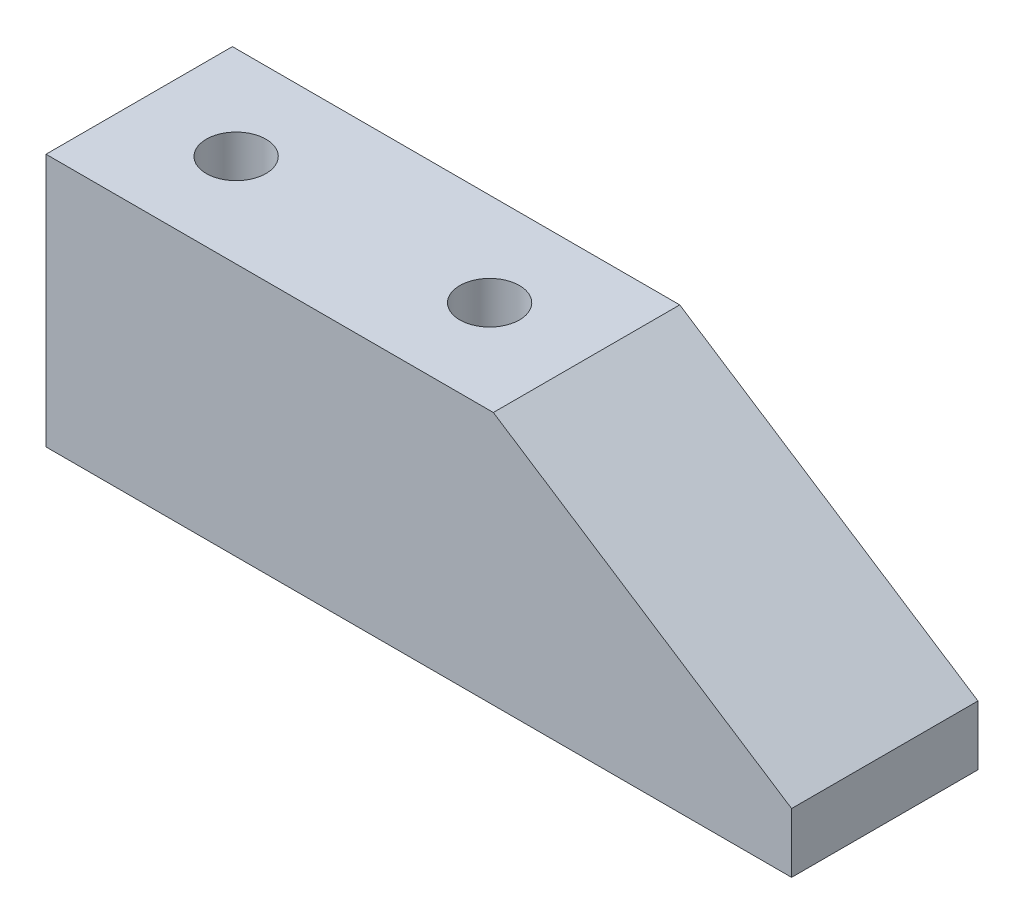
ISO-10303-21;
HEADER;
FILE_DESCRIPTION(('STEP AP214'),'2;1');
FILE_NAME('part.step','',(''),(''),'','','');
FILE_SCHEMA(('AUTOMOTIVE_DESIGN { 1 0 10303 214 1 1 1 1 }'));
ENDSEC;
DATA;
#1=APPLICATION_CONTEXT('core data for automotive mechanical design processes');
#2=APPLICATION_PROTOCOL_DEFINITION('international standard','automotive_design',2000,#1);
#3=PRODUCT_CONTEXT('',#1,'mechanical');
#4=PRODUCT('Part','Part','',(#3));
#5=PRODUCT_RELATED_PRODUCT_CATEGORY('part','',(#4));
#6=PRODUCT_DEFINITION_FORMATION('','',#4);
#7=PRODUCT_DEFINITION_CONTEXT('part definition',#1,'design');
#8=PRODUCT_DEFINITION('design','',#6,#7);
#9=PRODUCT_DEFINITION_SHAPE('','',#8);
#10=(LENGTH_UNIT() NAMED_UNIT(*) SI_UNIT(.MILLI.,.METRE.));
#11=(NAMED_UNIT(*) PLANE_ANGLE_UNIT() SI_UNIT($,.RADIAN.));
#12=(NAMED_UNIT(*) SI_UNIT($,.STERADIAN.) SOLID_ANGLE_UNIT());
#13=UNCERTAINTY_MEASURE_WITH_UNIT(LENGTH_MEASURE(1.E-05),#10,'distance_accuracy_value','');
#14=(GEOMETRIC_REPRESENTATION_CONTEXT(3) GLOBAL_UNCERTAINTY_ASSIGNED_CONTEXT((#13)) GLOBAL_UNIT_ASSIGNED_CONTEXT((#10,
#11,#12)) REPRESENTATION_CONTEXT('',''));
#15=CARTESIAN_POINT('',(0.,0.,0.));
#16=DIRECTION('',(0.,0.,1.));
#17=DIRECTION('',(1.,0.,0.));
#18=AXIS2_PLACEMENT_3D('',#15,#16,#17);
#19=CARTESIAN_POINT('',(30.,0.,12.5));
#20=DIRECTION('',(0.,-1.,0.));
#21=DIRECTION('',(1.,0.,0.));
#22=AXIS2_PLACEMENT_3D('',#19,#20,#21);
#23=PLANE('',#22);
#24=CARTESIAN_POINT('',(6.5,0.,6.25));
#25=DIRECTION('',(0.,1.,0.));
#26=DIRECTION('',(-1.,0.,0.));
#27=AXIS2_PLACEMENT_3D('',#24,#25,#26);
#28=CIRCLE('',#27,2.);
#29=CARTESIAN_POINT('',(4.5,0.,6.25));
#30=VERTEX_POINT('',#29);
#31=EDGE_CURVE('E162',#30,#30,#28,.T.);
#32=ORIENTED_EDGE('',*,*,#31,.F.);
#33=EDGE_LOOP('',(#32));
#34=FACE_BOUND('',#33,.T.);
#35=CARTESIAN_POINT('',(23.5,0.,6.25));
#36=DIRECTION('',(0.,1.,0.));
#37=DIRECTION('',(1.,0.,0.));
#38=AXIS2_PLACEMENT_3D('',#35,#36,#37);
#39=CIRCLE('',#38,2.);
#40=CARTESIAN_POINT('',(25.5,0.,6.25));
#41=VERTEX_POINT('',#40);
#42=EDGE_CURVE('E165',#41,#41,#39,.T.);
#43=ORIENTED_EDGE('',*,*,#42,.F.);
#44=EDGE_LOOP('',(#43));
#45=FACE_BOUND('',#44,.T.);
#46=DIRECTION('',(-1.,0.,0.));
#47=VECTOR('',#46,1.);
#48=CARTESIAN_POINT('',(30.,0.,0.));
#49=LINE('',#48,#47);
#50=CARTESIAN_POINT('',(30.,0.,0.));
#51=VERTEX_POINT('',#50);
#52=CARTESIAN_POINT('',(0.,0.,0.));
#53=VERTEX_POINT('',#52);
#54=EDGE_CURVE('E118',#51,#53,#49,.T.);
#55=ORIENTED_EDGE('',*,*,#54,.T.);
#56=DIRECTION('',(0.,0.,-1.));
#57=VECTOR('',#56,1.);
#58=CARTESIAN_POINT('',(0.,0.,12.5));
#59=LINE('',#58,#57);
#60=CARTESIAN_POINT('',(0.,0.,12.5));
#61=VERTEX_POINT('',#60);
#62=EDGE_CURVE('E11',#61,#53,#59,.T.);
#63=ORIENTED_EDGE('',*,*,#62,.F.);
#64=DIRECTION('',(-1.,0.,0.));
#65=VECTOR('',#64,1.);
#66=CARTESIAN_POINT('',(30.,0.,12.5));
#67=LINE('',#66,#65);
#68=CARTESIAN_POINT('',(30.,0.,12.5));
#69=VERTEX_POINT('',#68);
#70=EDGE_CURVE('E132',#69,#61,#67,.T.);
#71=ORIENTED_EDGE('',*,*,#70,.F.);
#72=DIRECTION('',(0.,0.,-1.));
#73=VECTOR('',#72,1.);
#74=CARTESIAN_POINT('',(30.,0.,12.5));
#75=LINE('',#74,#73);
#76=EDGE_CURVE('E114',#69,#51,#75,.T.);
#77=ORIENTED_EDGE('',*,*,#76,.T.);
#78=EDGE_LOOP('',(#55,#63,#71,#77));
#79=FACE_BOUND('',#78,.T.);
#80=ADVANCED_FACE('F39',(#34,#45,#79),#23,.F.);
#81=CARTESIAN_POINT('',(0.,0.,12.5));
#82=DIRECTION('',(1.,0.,0.));
#83=DIRECTION('',(0.,1.,0.));
#84=AXIS2_PLACEMENT_3D('',#81,#82,#83);
#85=PLANE('',#84);
#86=DIRECTION('',(0.,-1.,0.));
#87=VECTOR('',#86,1.);
#88=CARTESIAN_POINT('',(0.,0.,0.));
#89=LINE('',#88,#87);
#90=CARTESIAN_POINT('',(0.,-17.,0.));
#91=VERTEX_POINT('',#90);
#92=EDGE_CURVE('E122',#53,#91,#89,.T.);
#93=ORIENTED_EDGE('',*,*,#92,.T.);
#94=DIRECTION('',(0.,0.,-1.));
#95=VECTOR('',#94,1.);
#96=CARTESIAN_POINT('',(0.,-17.,12.5));
#97=LINE('',#96,#95);
#98=CARTESIAN_POINT('',(0.,-17.,12.5));
#99=VERTEX_POINT('',#98);
#100=EDGE_CURVE('E48',#99,#91,#97,.T.);
#101=ORIENTED_EDGE('',*,*,#100,.F.);
#102=DIRECTION('',(0.,-1.,0.));
#103=VECTOR('',#102,1.);
#104=CARTESIAN_POINT('',(0.,0.,12.5));
#105=LINE('',#104,#103);
#106=EDGE_CURVE('E90',#61,#99,#105,.T.);
#107=ORIENTED_EDGE('',*,*,#106,.F.);
#108=ORIENTED_EDGE('',*,*,#62,.T.);
#109=EDGE_LOOP('',(#93,#101,#107,#108));
#110=FACE_BOUND('',#109,.T.);
#111=ADVANCED_FACE('F154',(#110),#85,.F.);
#112=CARTESIAN_POINT('',(0.,-17.,12.5));
#113=DIRECTION('',(0.,1.,0.));
#114=DIRECTION('',(0.,0.,1.));
#115=AXIS2_PLACEMENT_3D('',#112,#113,#114);
#116=PLANE('',#115);
#117=DIRECTION('',(1.,0.,0.));
#118=VECTOR('',#117,1.);
#119=CARTESIAN_POINT('',(0.,-17.,0.));
#120=LINE('',#119,#118);
#121=CARTESIAN_POINT('',(50.,-17.,0.));
#122=VERTEX_POINT('',#121);
#123=EDGE_CURVE('E106',#91,#122,#120,.T.);
#124=ORIENTED_EDGE('',*,*,#123,.T.);
#125=DIRECTION('',(0.,0.,-1.));
#126=VECTOR('',#125,1.);
#127=CARTESIAN_POINT('',(50.,-17.,12.5));
#128=LINE('',#127,#126);
#129=CARTESIAN_POINT('',(50.,-17.,12.5));
#130=VERTEX_POINT('',#129);
#131=EDGE_CURVE('E103',#130,#122,#128,.T.);
#132=ORIENTED_EDGE('',*,*,#131,.F.);
#133=DIRECTION('',(1.,0.,0.));
#134=VECTOR('',#133,1.);
#135=CARTESIAN_POINT('',(0.,-17.,12.5));
#136=LINE('',#135,#134);
#137=EDGE_CURVE('E94',#99,#130,#136,.T.);
#138=ORIENTED_EDGE('',*,*,#137,.F.);
#139=ORIENTED_EDGE('',*,*,#100,.T.);
#140=EDGE_LOOP('',(#124,#132,#138,#139));
#141=FACE_BOUND('',#140,.T.);
#142=ADVANCED_FACE('F104',(#141),#116,.F.);
#143=CARTESIAN_POINT('',(50.,-17.,12.5));
#144=DIRECTION('',(-1.,0.,0.));
#145=DIRECTION('',(0.,0.,1.));
#146=AXIS2_PLACEMENT_3D('',#143,#144,#145);
#147=PLANE('',#146);
#148=DIRECTION('',(0.,1.,0.));
#149=VECTOR('',#148,1.);
#150=CARTESIAN_POINT('',(50.,-17.,0.));
#151=LINE('',#150,#149);
#152=CARTESIAN_POINT('',(50.,-13.,0.));
#153=VERTEX_POINT('',#152);
#154=EDGE_CURVE('E76',#122,#153,#151,.T.);
#155=ORIENTED_EDGE('',*,*,#154,.T.);
#156=DIRECTION('',(0.,0.,-1.));
#157=VECTOR('',#156,1.);
#158=CARTESIAN_POINT('',(50.,-13.,12.5));
#159=LINE('',#158,#157);
#160=CARTESIAN_POINT('',(50.,-13.,12.5));
#161=VERTEX_POINT('',#160);
#162=EDGE_CURVE('E108',#161,#153,#159,.T.);
#163=ORIENTED_EDGE('',*,*,#162,.F.);
#164=DIRECTION('',(0.,1.,0.));
#165=VECTOR('',#164,1.);
#166=CARTESIAN_POINT('',(50.,-17.,12.5));
#167=LINE('',#166,#165);
#168=EDGE_CURVE('E98',#130,#161,#167,.T.);
#169=ORIENTED_EDGE('',*,*,#168,.F.);
#170=ORIENTED_EDGE('',*,*,#131,.T.);
#171=EDGE_LOOP('',(#155,#163,#169,#170));
#172=FACE_BOUND('',#171,.T.);
#173=ADVANCED_FACE('F110',(#172),#147,.F.);
#174=CARTESIAN_POINT('',(50.,-13.,12.5));
#175=DIRECTION('',(-0.544988350595414,-0.838443616300637,0.));
#176=DIRECTION('',(0.838443616300637,-0.544988350595414,0.));
#177=AXIS2_PLACEMENT_3D('',#174,#175,#176);
#178=PLANE('',#177);
#179=DIRECTION('',(-0.838443616300637,0.544988350595414,0.));
#180=VECTOR('',#179,1.);
#181=CARTESIAN_POINT('',(50.,-13.,0.));
#182=LINE('',#181,#180);
#183=EDGE_CURVE('E82',#153,#51,#182,.T.);
#184=ORIENTED_EDGE('',*,*,#183,.T.);
#185=ORIENTED_EDGE('',*,*,#76,.F.);
#186=DIRECTION('',(-0.838443616300637,0.544988350595414,0.));
#187=VECTOR('',#186,1.);
#188=CARTESIAN_POINT('',(50.,-13.,12.5));
#189=LINE('',#188,#187);
#190=EDGE_CURVE('E56',#161,#69,#189,.T.);
#191=ORIENTED_EDGE('',*,*,#190,.F.);
#192=ORIENTED_EDGE('',*,*,#162,.T.);
#193=EDGE_LOOP('',(#184,#185,#191,#192));
#194=FACE_BOUND('',#193,.T.);
#195=ADVANCED_FACE('F143',(#194),#178,.F.);
#196=CARTESIAN_POINT('',(0.,0.,12.5));
#197=DIRECTION('',(0.,0.,1.));
#198=DIRECTION('',(1.,0.,0.));
#199=AXIS2_PLACEMENT_3D('',#196,#197,#198);
#200=PLANE('',#199);
#201=ORIENTED_EDGE('',*,*,#70,.T.);
#202=ORIENTED_EDGE('',*,*,#106,.T.);
#203=ORIENTED_EDGE('',*,*,#137,.T.);
#204=ORIENTED_EDGE('',*,*,#168,.T.);
#205=ORIENTED_EDGE('',*,*,#190,.T.);
#206=EDGE_LOOP('',(#201,#202,#203,#204,#205));
#207=FACE_BOUND('',#206,.T.);
#208=ADVANCED_FACE('F96',(#207),#200,.T.);
#209=CARTESIAN_POINT('',(0.,0.,0.));
#210=DIRECTION('',(0.,0.,1.));
#211=DIRECTION('',(1.,0.,0.));
#212=AXIS2_PLACEMENT_3D('',#209,#210,#211);
#213=PLANE('',#212);
#214=ORIENTED_EDGE('',*,*,#54,.F.);
#215=ORIENTED_EDGE('',*,*,#183,.F.);
#216=ORIENTED_EDGE('',*,*,#154,.F.);
#217=ORIENTED_EDGE('',*,*,#123,.F.);
#218=ORIENTED_EDGE('',*,*,#92,.F.);
#219=EDGE_LOOP('',(#214,#215,#216,#217,#218));
#220=FACE_BOUND('',#219,.T.);
#221=ADVANCED_FACE('F139',(#220),#213,.F.);
#222=CARTESIAN_POINT('',(23.5,-8.,6.25));
#223=DIRECTION('',(0.,1.,0.));
#224=DIRECTION('',(-1.,0.,0.));
#225=AXIS2_PLACEMENT_3D('',#222,#223,#224);
#226=CYLINDRICAL_SURFACE('',#225,2.);
#227=CARTESIAN_POINT('',(23.5,-8.,6.25));
#228=DIRECTION('',(0.,1.,0.));
#229=DIRECTION('',(1.,0.,0.));
#230=AXIS2_PLACEMENT_3D('',#227,#228,#229);
#231=CIRCLE('',#230,2.);
#232=CARTESIAN_POINT('',(25.5,-8.,6.25));
#233=VERTEX_POINT('',#232);
#234=EDGE_CURVE('E168',#233,#233,#231,.T.);
#235=ORIENTED_EDGE('',*,*,#234,.F.);
#236=EDGE_LOOP('',(#235));
#237=FACE_BOUND('',#236,.T.);
#238=ORIENTED_EDGE('',*,*,#42,.T.);
#239=EDGE_LOOP('',(#238));
#240=FACE_BOUND('',#239,.T.);
#241=ADVANCED_FACE('F194',(#237,#240),#226,.F.);
#242=CARTESIAN_POINT('',(23.5,-8.,6.25));
#243=DIRECTION('',(0.,-1.,0.));
#244=DIRECTION('',(1.,0.,0.));
#245=AXIS2_PLACEMENT_3D('',#242,#243,#244);
#246=PLANE('',#245);
#247=ORIENTED_EDGE('',*,*,#234,.T.);
#248=EDGE_LOOP('',(#247));
#249=FACE_BOUND('',#248,.T.);
#250=ADVANCED_FACE('F185',(#249),#246,.F.);
#251=CARTESIAN_POINT('',(6.5,-8.,6.25));
#252=DIRECTION('',(0.,1.,0.));
#253=DIRECTION('',(-1.,0.,0.));
#254=AXIS2_PLACEMENT_3D('',#251,#252,#253);
#255=CYLINDRICAL_SURFACE('',#254,2.);
#256=CARTESIAN_POINT('',(6.5,-8.,6.25));
#257=DIRECTION('',(0.,1.,0.));
#258=DIRECTION('',(-1.,0.,0.));
#259=AXIS2_PLACEMENT_3D('',#256,#257,#258);
#260=CIRCLE('',#259,2.);
#261=CARTESIAN_POINT('',(4.5,-8.,6.25));
#262=VERTEX_POINT('',#261);
#263=EDGE_CURVE('E123',#262,#262,#260,.T.);
#264=ORIENTED_EDGE('',*,*,#263,.F.);
#265=EDGE_LOOP('',(#264));
#266=FACE_BOUND('',#265,.T.);
#267=ORIENTED_EDGE('',*,*,#31,.T.);
#268=EDGE_LOOP('',(#267));
#269=FACE_BOUND('',#268,.T.);
#270=ADVANCED_FACE('F182',(#266,#269),#255,.F.);
#271=CARTESIAN_POINT('',(6.5,-8.,6.25));
#272=DIRECTION('',(0.,1.,0.));
#273=DIRECTION('',(-1.,0.,0.));
#274=AXIS2_PLACEMENT_3D('',#271,#272,#273);
#275=PLANE('',#274);
#276=ORIENTED_EDGE('',*,*,#263,.T.);
#277=EDGE_LOOP('',(#276));
#278=FACE_BOUND('',#277,.T.);
#279=ADVANCED_FACE('F184',(#278),#275,.T.);
#280=CLOSED_SHELL('',(#80,#111,#142,#173,#195,#208,#221,#241,#250,#270,#279));
#281=MANIFOLD_SOLID_BREP('B2',#280);
#282=ADVANCED_BREP_SHAPE_REPRESENTATION('',(#18,#281),#14);
#283=SHAPE_DEFINITION_REPRESENTATION(#9,#282);
ENDSEC;
END-ISO-10303-21;
